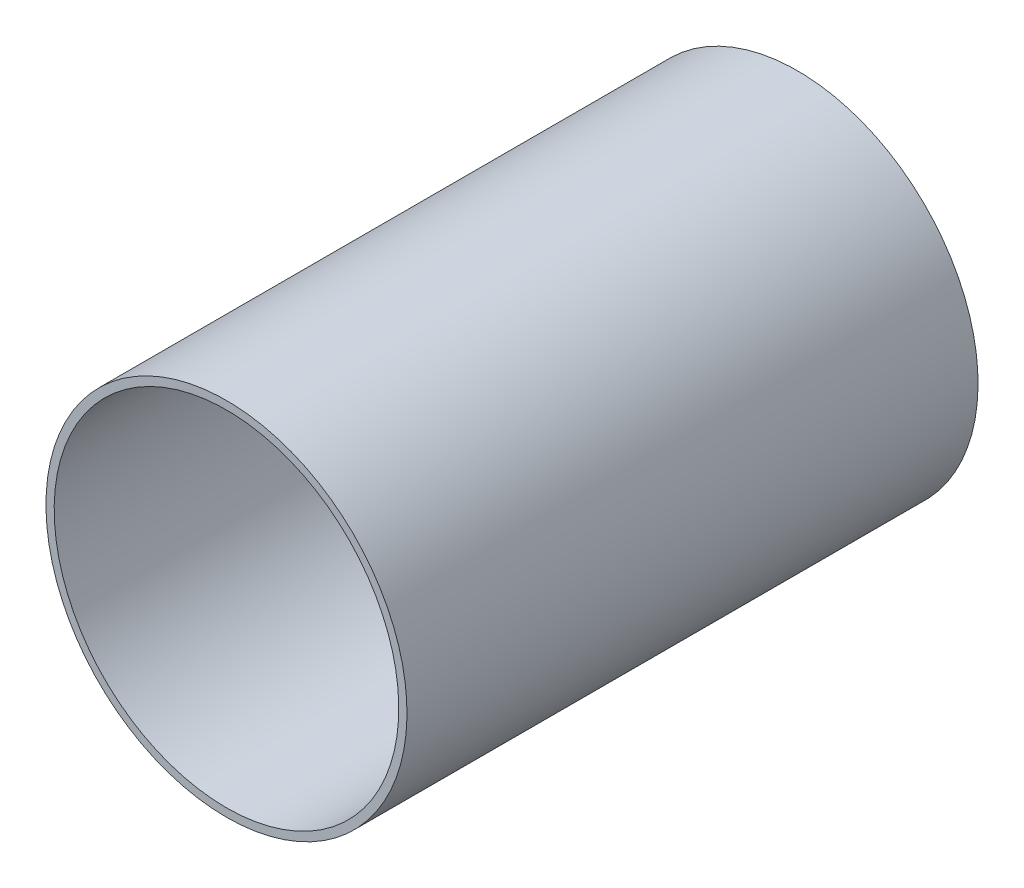
ISO-10303-21;
HEADER;
FILE_DESCRIPTION(('STEP AP214'),'2;1');
FILE_NAME('part.step','',(''),(''),'','','');
FILE_SCHEMA(('AUTOMOTIVE_DESIGN { 1 0 10303 214 1 1 1 1 }'));
ENDSEC;
DATA;
#1=APPLICATION_CONTEXT('core data for automotive mechanical design processes');
#2=APPLICATION_PROTOCOL_DEFINITION('international standard','automotive_design',2000,#1);
#3=PRODUCT_CONTEXT('',#1,'mechanical');
#4=PRODUCT('Part','Part','',(#3));
#5=PRODUCT_RELATED_PRODUCT_CATEGORY('part','',(#4));
#6=PRODUCT_DEFINITION_FORMATION('','',#4);
#7=PRODUCT_DEFINITION_CONTEXT('part definition',#1,'design');
#8=PRODUCT_DEFINITION('design','',#6,#7);
#9=PRODUCT_DEFINITION_SHAPE('','',#8);
#10=(LENGTH_UNIT() NAMED_UNIT(*) SI_UNIT(.MILLI.,.METRE.));
#11=(NAMED_UNIT(*) PLANE_ANGLE_UNIT() SI_UNIT($,.RADIAN.));
#12=(NAMED_UNIT(*) SI_UNIT($,.STERADIAN.) SOLID_ANGLE_UNIT());
#13=UNCERTAINTY_MEASURE_WITH_UNIT(LENGTH_MEASURE(1.E-05),#10,'distance_accuracy_value','');
#14=(GEOMETRIC_REPRESENTATION_CONTEXT(3) GLOBAL_UNCERTAINTY_ASSIGNED_CONTEXT((#13)) GLOBAL_UNIT_ASSIGNED_CONTEXT((#10,
#11,#12)) REPRESENTATION_CONTEXT('',''));
#15=CARTESIAN_POINT('',(0.,0.,0.));
#16=DIRECTION('',(0.,0.,1.));
#17=DIRECTION('',(1.,0.,0.));
#18=AXIS2_PLACEMENT_3D('',#15,#16,#17);
#19=CARTESIAN_POINT('',(123.952,-125.984,-0.045));
#20=DIRECTION('',(0.,0.,-1.));
#21=DIRECTION('',(0.,-1.,0.));
#22=AXIS2_PLACEMENT_3D('',#19,#20,#21);
#23=CYLINDRICAL_SURFACE('',#22,0.525);
#24=CARTESIAN_POINT('',(123.952,-125.984,-0.035));
#25=DIRECTION('',(0.,0.,-1.));
#26=DIRECTION('',(0.,-1.,0.));
#27=AXIS2_PLACEMENT_3D('',#24,#25,#26);
#28=CIRCLE('',#27,0.525);
#29=CARTESIAN_POINT('',(123.952,-126.509,-0.035));
#30=VERTEX_POINT('',#29);
#31=EDGE_CURVE('E62',#30,#30,#28,.T.);
#32=ORIENTED_EDGE('',*,*,#31,.T.);
#33=DIRECTION('',(0.,0.,1.));
#34=VECTOR('',#33,1.);
#35=CARTESIAN_POINT('',(123.952,-126.509,-0.045));
#36=LINE('',#35,#34);
#37=CARTESIAN_POINT('',(123.952,-126.509,1.705));
#38=VERTEX_POINT('',#37);
#39=EDGE_CURVE('E11',#30,#38,#36,.T.);
#40=ORIENTED_EDGE('',*,*,#39,.T.);
#41=CARTESIAN_POINT('',(123.952,-125.984,1.705));
#42=DIRECTION('',(0.,0.,-1.));
#43=DIRECTION('',(0.,-1.,0.));
#44=AXIS2_PLACEMENT_3D('',#41,#42,#43);
#45=CIRCLE('',#44,0.525);
#46=EDGE_CURVE('E26',#38,#38,#45,.T.);
#47=ORIENTED_EDGE('',*,*,#46,.F.);
#48=ORIENTED_EDGE('',*,*,#39,.F.);
#49=EDGE_LOOP('',(#32,#40,#47,#48));
#50=FACE_BOUND('',#49,.T.);
#51=ADVANCED_FACE('F17',(#50),#23,.F.);
#52=CARTESIAN_POINT('',(123.952,-126.534,1.705));
#53=DIRECTION('',(0.,0.,1.));
#54=DIRECTION('',(1.,0.,0.));
#55=AXIS2_PLACEMENT_3D('',#52,#53,#54);
#56=PLANE('',#55);
#57=ORIENTED_EDGE('',*,*,#46,.T.);
#58=EDGE_LOOP('',(#57));
#59=FACE_BOUND('',#58,.T.);
#60=CARTESIAN_POINT('',(123.952,-125.984,1.705));
#61=DIRECTION('',(0.,0.,1.));
#62=DIRECTION('',(0.,-1.,0.));
#63=AXIS2_PLACEMENT_3D('',#60,#61,#62);
#64=CIRCLE('',#63,0.55);
#65=CARTESIAN_POINT('',(123.952,-126.534,1.705));
#66=VERTEX_POINT('',#65);
#67=EDGE_CURVE('E54',#66,#66,#64,.T.);
#68=ORIENTED_EDGE('',*,*,#67,.T.);
#69=EDGE_LOOP('',(#68));
#70=FACE_BOUND('',#69,.T.);
#71=ADVANCED_FACE('F71',(#59,#70),#56,.T.);
#72=CARTESIAN_POINT('',(123.952,-126.534,-0.035));
#73=DIRECTION('',(0.,0.,1.));
#74=DIRECTION('',(1.,0.,0.));
#75=AXIS2_PLACEMENT_3D('',#72,#73,#74);
#76=PLANE('',#75);
#77=ORIENTED_EDGE('',*,*,#31,.F.);
#78=EDGE_LOOP('',(#77));
#79=FACE_BOUND('',#78,.T.);
#80=CARTESIAN_POINT('',(123.952,-125.984,-0.035));
#81=DIRECTION('',(0.,0.,1.));
#82=DIRECTION('',(0.,-1.,0.));
#83=AXIS2_PLACEMENT_3D('',#80,#81,#82);
#84=CIRCLE('',#83,0.55);
#85=CARTESIAN_POINT('',(123.952,-126.534,-0.035));
#86=VERTEX_POINT('',#85);
#87=EDGE_CURVE('E53',#86,#86,#84,.T.);
#88=ORIENTED_EDGE('',*,*,#87,.F.);
#89=EDGE_LOOP('',(#88));
#90=FACE_BOUND('',#89,.T.);
#91=ADVANCED_FACE('F75',(#79,#90),#76,.F.);
#92=CARTESIAN_POINT('',(123.952,-125.984,-0.035));
#93=DIRECTION('',(0.,0.,-1.));
#94=DIRECTION('',(0.,-1.,0.));
#95=AXIS2_PLACEMENT_3D('',#92,#93,#94);
#96=CYLINDRICAL_SURFACE('',#95,0.55);
#97=ORIENTED_EDGE('',*,*,#87,.T.);
#98=DIRECTION('',(0.,0.,1.));
#99=VECTOR('',#98,1.);
#100=CARTESIAN_POINT('',(123.952,-126.534,-0.035));
#101=LINE('',#100,#99);
#102=EDGE_CURVE('E50',#86,#66,#101,.T.);
#103=ORIENTED_EDGE('',*,*,#102,.T.);
#104=ORIENTED_EDGE('',*,*,#67,.F.);
#105=ORIENTED_EDGE('',*,*,#102,.F.);
#106=EDGE_LOOP('',(#97,#103,#104,#105));
#107=FACE_BOUND('',#106,.T.);
#108=ADVANCED_FACE('F51',(#107),#96,.T.);
#109=CLOSED_SHELL('',(#51,#71,#91,#108));
#110=MANIFOLD_SOLID_BREP('B1',#109);
#111=ADVANCED_BREP_SHAPE_REPRESENTATION('',(#18,#110),#14);
#112=SHAPE_DEFINITION_REPRESENTATION(#9,#111);
ENDSEC;
END-ISO-10303-21;
